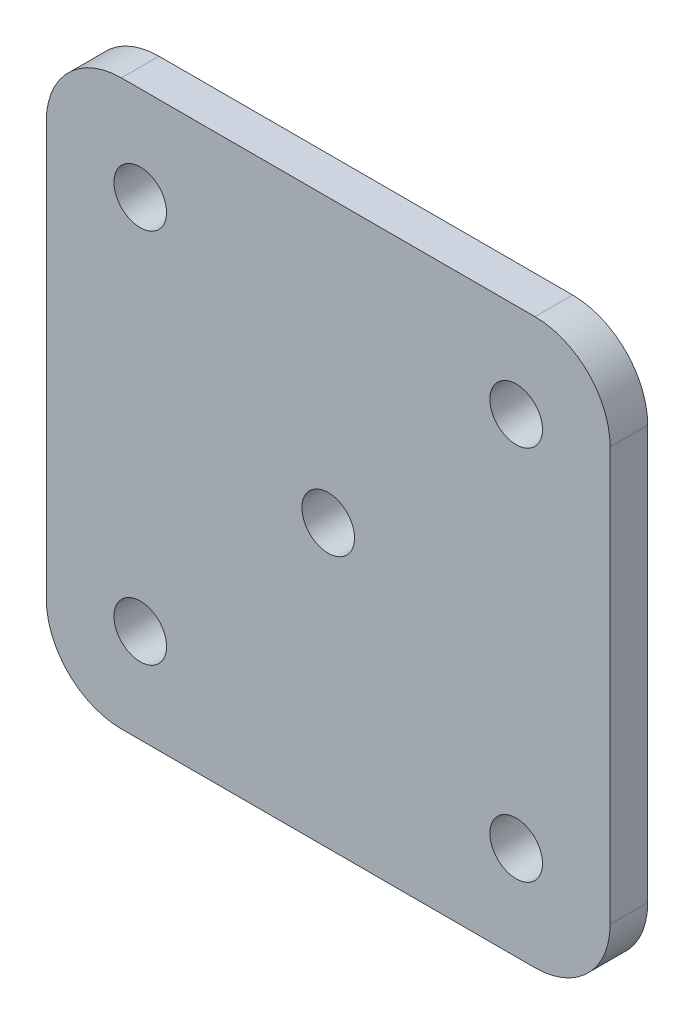
ISO-10303-21;
HEADER;
FILE_DESCRIPTION(('STEP AP214'),'2;1');
FILE_NAME('part.step','',(''),(''),'','','');
FILE_SCHEMA(('AUTOMOTIVE_DESIGN { 1 0 10303 214 1 1 1 1 }'));
ENDSEC;
DATA;
#1=APPLICATION_CONTEXT('core data for automotive mechanical design processes');
#2=APPLICATION_PROTOCOL_DEFINITION('international standard','automotive_design',2000,#1);
#3=PRODUCT_CONTEXT('',#1,'mechanical');
#4=PRODUCT('Part','Part','',(#3));
#5=PRODUCT_RELATED_PRODUCT_CATEGORY('part','',(#4));
#6=PRODUCT_DEFINITION_FORMATION('','',#4);
#7=PRODUCT_DEFINITION_CONTEXT('part definition',#1,'design');
#8=PRODUCT_DEFINITION('design','',#6,#7);
#9=PRODUCT_DEFINITION_SHAPE('','',#8);
#10=(LENGTH_UNIT() NAMED_UNIT(*) SI_UNIT(.MILLI.,.METRE.));
#11=(NAMED_UNIT(*) PLANE_ANGLE_UNIT() SI_UNIT($,.RADIAN.));
#12=(NAMED_UNIT(*) SI_UNIT($,.STERADIAN.) SOLID_ANGLE_UNIT());
#13=UNCERTAINTY_MEASURE_WITH_UNIT(LENGTH_MEASURE(1.E-05),#10,'distance_accuracy_value','');
#14=(GEOMETRIC_REPRESENTATION_CONTEXT(3) GLOBAL_UNCERTAINTY_ASSIGNED_CONTEXT((#13)) GLOBAL_UNIT_ASSIGNED_CONTEXT((#10,
#11,#12)) REPRESENTATION_CONTEXT('',''));
#15=CARTESIAN_POINT('',(0.,0.,0.));
#16=DIRECTION('',(0.,0.,1.));
#17=DIRECTION('',(1.,0.,0.));
#18=AXIS2_PLACEMENT_3D('',#15,#16,#17);
#19=CARTESIAN_POINT('',(-37.5,37.5,5.));
#20=DIRECTION('',(1.,0.,0.));
#21=DIRECTION('',(0.,1.,0.));
#22=AXIS2_PLACEMENT_3D('',#19,#20,#21);
#23=PLANE('',#22);
#24=DIRECTION('',(0.,-1.,0.));
#25=VECTOR('',#24,1.);
#26=CARTESIAN_POINT('',(-37.5,37.5,5.));
#27=LINE('',#26,#25);
#28=CARTESIAN_POINT('',(-37.5,27.5,5.));
#29=VERTEX_POINT('',#28);
#30=CARTESIAN_POINT('',(-37.5,-27.5,5.));
#31=VERTEX_POINT('',#30);
#32=EDGE_CURVE('E117',#29,#31,#27,.T.);
#33=ORIENTED_EDGE('',*,*,#32,.F.);
#34=DIRECTION('',(0.,0.,-1.));
#35=VECTOR('',#34,1.);
#36=CARTESIAN_POINT('',(-37.5,27.5,5.));
#37=LINE('',#36,#35);
#38=CARTESIAN_POINT('',(-37.5,27.5,0.));
#39=VERTEX_POINT('',#38);
#40=EDGE_CURVE('E102',#29,#39,#37,.T.);
#41=ORIENTED_EDGE('',*,*,#40,.T.);
#42=DIRECTION('',(0.,-1.,0.));
#43=VECTOR('',#42,1.);
#44=CARTESIAN_POINT('',(-37.5,37.5,0.));
#45=LINE('',#44,#43);
#46=CARTESIAN_POINT('',(-37.5,-27.5,0.));
#47=VERTEX_POINT('',#46);
#48=EDGE_CURVE('E114',#39,#47,#45,.T.);
#49=ORIENTED_EDGE('',*,*,#48,.T.);
#50=DIRECTION('',(0.,0.,-1.));
#51=VECTOR('',#50,1.);
#52=CARTESIAN_POINT('',(-37.5,-27.5,5.));
#53=LINE('',#52,#51);
#54=EDGE_CURVE('E119',#47,#31,#53,.F.);
#55=ORIENTED_EDGE('',*,*,#54,.T.);
#56=EDGE_LOOP('',(#33,#41,#49,#55));
#57=FACE_BOUND('',#56,.T.);
#58=ADVANCED_FACE('F32',(#57),#23,.F.);
#59=CARTESIAN_POINT('',(-37.5,-37.5,5.));
#60=DIRECTION('',(0.,1.,0.));
#61=DIRECTION('',(-1.,0.,0.));
#62=AXIS2_PLACEMENT_3D('',#59,#60,#61);
#63=PLANE('',#62);
#64=DIRECTION('',(1.,0.,0.));
#65=VECTOR('',#64,1.);
#66=CARTESIAN_POINT('',(-37.5,-37.5,5.));
#67=LINE('',#66,#65);
#68=CARTESIAN_POINT('',(-27.5,-37.5,5.));
#69=VERTEX_POINT('',#68);
#70=CARTESIAN_POINT('',(27.5,-37.5,5.));
#71=VERTEX_POINT('',#70);
#72=EDGE_CURVE('E163',#69,#71,#67,.T.);
#73=ORIENTED_EDGE('',*,*,#72,.F.);
#74=DIRECTION('',(0.,0.,-1.));
#75=VECTOR('',#74,1.);
#76=CARTESIAN_POINT('',(-27.5,-37.5,5.));
#77=LINE('',#76,#75);
#78=CARTESIAN_POINT('',(-27.5,-37.5,0.));
#79=VERTEX_POINT('',#78);
#80=EDGE_CURVE('E156',#69,#79,#77,.T.);
#81=ORIENTED_EDGE('',*,*,#80,.T.);
#82=DIRECTION('',(1.,0.,0.));
#83=VECTOR('',#82,1.);
#84=CARTESIAN_POINT('',(-37.5,-37.5,0.));
#85=LINE('',#84,#83);
#86=CARTESIAN_POINT('',(27.5,-37.5,0.));
#87=VERTEX_POINT('',#86);
#88=EDGE_CURVE('E123',#79,#87,#85,.T.);
#89=ORIENTED_EDGE('',*,*,#88,.T.);
#90=DIRECTION('',(0.,0.,-1.));
#91=VECTOR('',#90,1.);
#92=CARTESIAN_POINT('',(27.5,-37.5,5.));
#93=LINE('',#92,#91);
#94=EDGE_CURVE('E154',#87,#71,#93,.F.);
#95=ORIENTED_EDGE('',*,*,#94,.T.);
#96=EDGE_LOOP('',(#73,#81,#89,#95));
#97=FACE_BOUND('',#96,.T.);
#98=ADVANCED_FACE('F161',(#97),#63,.F.);
#99=CARTESIAN_POINT('',(37.5,37.5,5.));
#100=DIRECTION('',(-1.,0.,0.));
#101=DIRECTION('',(0.,0.,1.));
#102=AXIS2_PLACEMENT_3D('',#99,#100,#101);
#103=PLANE('',#102);
#104=DIRECTION('',(0.,1.,0.));
#105=VECTOR('',#104,1.);
#106=CARTESIAN_POINT('',(37.5,37.5,5.));
#107=LINE('',#106,#105);
#108=CARTESIAN_POINT('',(37.5,-27.5,5.));
#109=VERTEX_POINT('',#108);
#110=CARTESIAN_POINT('',(37.5,27.5,5.));
#111=VERTEX_POINT('',#110);
#112=EDGE_CURVE('E171',#109,#111,#107,.T.);
#113=ORIENTED_EDGE('',*,*,#112,.F.);
#114=DIRECTION('',(0.,0.,-1.));
#115=VECTOR('',#114,1.);
#116=CARTESIAN_POINT('',(37.5,-27.5,5.));
#117=LINE('',#116,#115);
#118=CARTESIAN_POINT('',(37.5,-27.5,0.));
#119=VERTEX_POINT('',#118);
#120=EDGE_CURVE('E11',#109,#119,#117,.T.);
#121=ORIENTED_EDGE('',*,*,#120,.T.);
#122=DIRECTION('',(0.,1.,0.));
#123=VECTOR('',#122,1.);
#124=CARTESIAN_POINT('',(37.5,37.5,0.));
#125=LINE('',#124,#123);
#126=CARTESIAN_POINT('',(37.5,27.5,0.));
#127=VERTEX_POINT('',#126);
#128=EDGE_CURVE('E127',#119,#127,#125,.T.);
#129=ORIENTED_EDGE('',*,*,#128,.T.);
#130=DIRECTION('',(0.,0.,-1.));
#131=VECTOR('',#130,1.);
#132=CARTESIAN_POINT('',(37.5,27.5,5.));
#133=LINE('',#132,#131);
#134=EDGE_CURVE('E40',#127,#111,#133,.F.);
#135=ORIENTED_EDGE('',*,*,#134,.T.);
#136=EDGE_LOOP('',(#113,#121,#129,#135));
#137=FACE_BOUND('',#136,.T.);
#138=ADVANCED_FACE('F170',(#137),#103,.F.);
#139=CARTESIAN_POINT('',(-37.5,37.5,5.));
#140=DIRECTION('',(0.,-1.,0.));
#141=DIRECTION('',(1.,0.,0.));
#142=AXIS2_PLACEMENT_3D('',#139,#140,#141);
#143=PLANE('',#142);
#144=DIRECTION('',(-1.,0.,0.));
#145=VECTOR('',#144,1.);
#146=CARTESIAN_POINT('',(-37.5,37.5,0.));
#147=LINE('',#146,#145);
#148=CARTESIAN_POINT('',(27.5,37.5,0.));
#149=VERTEX_POINT('',#148);
#150=CARTESIAN_POINT('',(-27.5,37.5,0.));
#151=VERTEX_POINT('',#150);
#152=EDGE_CURVE('E137',#149,#151,#147,.T.);
#153=ORIENTED_EDGE('',*,*,#152,.T.);
#154=DIRECTION('',(0.,0.,-1.));
#155=VECTOR('',#154,1.);
#156=CARTESIAN_POINT('',(-27.5,37.5,5.));
#157=LINE('',#156,#155);
#158=CARTESIAN_POINT('',(-27.5,37.5,5.));
#159=VERTEX_POINT('',#158);
#160=EDGE_CURVE('E103',#151,#159,#157,.F.);
#161=ORIENTED_EDGE('',*,*,#160,.T.);
#162=DIRECTION('',(-1.,0.,0.));
#163=VECTOR('',#162,1.);
#164=CARTESIAN_POINT('',(-37.5,37.5,5.));
#165=LINE('',#164,#163);
#166=CARTESIAN_POINT('',(27.5,37.5,5.));
#167=VERTEX_POINT('',#166);
#168=EDGE_CURVE('E133',#167,#159,#165,.T.);
#169=ORIENTED_EDGE('',*,*,#168,.F.);
#170=DIRECTION('',(0.,0.,-1.));
#171=VECTOR('',#170,1.);
#172=CARTESIAN_POINT('',(27.5,37.5,5.));
#173=LINE('',#172,#171);
#174=EDGE_CURVE('E108',#167,#149,#173,.T.);
#175=ORIENTED_EDGE('',*,*,#174,.T.);
#176=EDGE_LOOP('',(#153,#161,#169,#175));
#177=FACE_BOUND('',#176,.T.);
#178=ADVANCED_FACE('F209',(#177),#143,.F.);
#179=CARTESIAN_POINT('',(0.,0.,5.));
#180=DIRECTION('',(0.,0.,1.));
#181=DIRECTION('',(1.,0.,0.));
#182=AXIS2_PLACEMENT_3D('',#179,#180,#181);
#183=PLANE('',#182);
#184=CARTESIAN_POINT('',(0.,0.,5.));
#185=DIRECTION('',(0.,0.,1.));
#186=DIRECTION('',(1.,0.,0.));
#187=AXIS2_PLACEMENT_3D('',#184,#185,#186);
#188=CIRCLE('',#187,3.5);
#189=CARTESIAN_POINT('',(3.5,0.,5.));
#190=VERTEX_POINT('',#189);
#191=EDGE_CURVE('E200',#190,#190,#188,.T.);
#192=ORIENTED_EDGE('',*,*,#191,.F.);
#193=EDGE_LOOP('',(#192));
#194=FACE_BOUND('',#193,.T.);
#195=CARTESIAN_POINT('',(-25.,25.,5.));
#196=DIRECTION('',(0.,0.,1.));
#197=DIRECTION('',(1.,0.,0.));
#198=AXIS2_PLACEMENT_3D('',#195,#196,#197);
#199=CIRCLE('',#198,3.5);
#200=CARTESIAN_POINT('',(-21.5,25.,5.));
#201=VERTEX_POINT('',#200);
#202=EDGE_CURVE('E194',#201,#201,#199,.T.);
#203=ORIENTED_EDGE('',*,*,#202,.F.);
#204=EDGE_LOOP('',(#203));
#205=FACE_BOUND('',#204,.T.);
#206=CARTESIAN_POINT('',(-25.,-25.,5.));
#207=DIRECTION('',(0.,0.,1.));
#208=DIRECTION('',(1.,0.,0.));
#209=AXIS2_PLACEMENT_3D('',#206,#207,#208);
#210=CIRCLE('',#209,3.5);
#211=CARTESIAN_POINT('',(-21.5,-25.,5.));
#212=VERTEX_POINT('',#211);
#213=EDGE_CURVE('E188',#212,#212,#210,.T.);
#214=ORIENTED_EDGE('',*,*,#213,.F.);
#215=EDGE_LOOP('',(#214));
#216=FACE_BOUND('',#215,.T.);
#217=CARTESIAN_POINT('',(25.,-25.,5.));
#218=DIRECTION('',(0.,0.,1.));
#219=DIRECTION('',(1.,0.,0.));
#220=AXIS2_PLACEMENT_3D('',#217,#218,#219);
#221=CIRCLE('',#220,3.5);
#222=CARTESIAN_POINT('',(28.5,-25.,5.));
#223=VERTEX_POINT('',#222);
#224=EDGE_CURVE('E182',#223,#223,#221,.T.);
#225=ORIENTED_EDGE('',*,*,#224,.F.);
#226=EDGE_LOOP('',(#225));
#227=FACE_BOUND('',#226,.T.);
#228=CARTESIAN_POINT('',(25.,25.,5.));
#229=DIRECTION('',(0.,0.,1.));
#230=DIRECTION('',(1.,0.,0.));
#231=AXIS2_PLACEMENT_3D('',#228,#229,#230);
#232=CIRCLE('',#231,3.5);
#233=CARTESIAN_POINT('',(28.5,25.,5.));
#234=VERTEX_POINT('',#233);
#235=EDGE_CURVE('E130',#234,#234,#232,.T.);
#236=ORIENTED_EDGE('',*,*,#235,.F.);
#237=EDGE_LOOP('',(#236));
#238=FACE_BOUND('',#237,.T.);
#239=ORIENTED_EDGE('',*,*,#168,.T.);
#240=CARTESIAN_POINT('',(-27.5,27.5,5.));
#241=DIRECTION('',(0.,0.,1.));
#242=DIRECTION('',(1.,0.,0.));
#243=AXIS2_PLACEMENT_3D('',#240,#241,#242);
#244=CIRCLE('',#243,10.);
#245=EDGE_CURVE('E152',#159,#29,#244,.T.);
#246=ORIENTED_EDGE('',*,*,#245,.T.);
#247=ORIENTED_EDGE('',*,*,#32,.T.);
#248=CARTESIAN_POINT('',(-27.5,-27.5,5.));
#249=DIRECTION('',(0.,0.,1.));
#250=DIRECTION('',(1.,0.,0.));
#251=AXIS2_PLACEMENT_3D('',#248,#249,#250);
#252=CIRCLE('',#251,10.);
#253=EDGE_CURVE('E150',#31,#69,#252,.T.);
#254=ORIENTED_EDGE('',*,*,#253,.T.);
#255=ORIENTED_EDGE('',*,*,#72,.T.);
#256=CARTESIAN_POINT('',(27.5,-27.5,5.));
#257=DIRECTION('',(0.,0.,1.));
#258=DIRECTION('',(1.,0.,0.));
#259=AXIS2_PLACEMENT_3D('',#256,#257,#258);
#260=CIRCLE('',#259,10.);
#261=EDGE_CURVE('E53',#71,#109,#260,.T.);
#262=ORIENTED_EDGE('',*,*,#261,.T.);
#263=ORIENTED_EDGE('',*,*,#112,.T.);
#264=CARTESIAN_POINT('',(27.5,27.5,5.));
#265=DIRECTION('',(0.,0.,1.));
#266=DIRECTION('',(1.,0.,0.));
#267=AXIS2_PLACEMENT_3D('',#264,#265,#266);
#268=CIRCLE('',#267,10.);
#269=EDGE_CURVE('E147',#111,#167,#268,.T.);
#270=ORIENTED_EDGE('',*,*,#269,.T.);
#271=EDGE_LOOP('',(#239,#246,#247,#254,#255,#262,#263,#270));
#272=FACE_BOUND('',#271,.T.);
#273=ADVANCED_FACE('F206',(#194,#205,#216,#227,#238,#272),#183,.T.);
#274=CARTESIAN_POINT('',(0.,0.,0.));
#275=DIRECTION('',(0.,0.,1.));
#276=DIRECTION('',(1.,0.,0.));
#277=AXIS2_PLACEMENT_3D('',#274,#275,#276);
#278=PLANE('',#277);
#279=CARTESIAN_POINT('',(0.,0.,0.));
#280=DIRECTION('',(0.,0.,1.));
#281=DIRECTION('',(1.,0.,0.));
#282=AXIS2_PLACEMENT_3D('',#279,#280,#281);
#283=CIRCLE('',#282,3.5);
#284=CARTESIAN_POINT('',(3.5,0.,0.));
#285=VERTEX_POINT('',#284);
#286=EDGE_CURVE('E197',#285,#285,#283,.T.);
#287=ORIENTED_EDGE('',*,*,#286,.T.);
#288=EDGE_LOOP('',(#287));
#289=FACE_BOUND('',#288,.T.);
#290=CARTESIAN_POINT('',(-25.,25.,0.));
#291=DIRECTION('',(0.,0.,1.));
#292=DIRECTION('',(1.,0.,0.));
#293=AXIS2_PLACEMENT_3D('',#290,#291,#292);
#294=CIRCLE('',#293,3.5);
#295=CARTESIAN_POINT('',(-21.5,25.,0.));
#296=VERTEX_POINT('',#295);
#297=EDGE_CURVE('E191',#296,#296,#294,.T.);
#298=ORIENTED_EDGE('',*,*,#297,.T.);
#299=EDGE_LOOP('',(#298));
#300=FACE_BOUND('',#299,.T.);
#301=CARTESIAN_POINT('',(-25.,-25.,0.));
#302=DIRECTION('',(0.,0.,1.));
#303=DIRECTION('',(1.,0.,0.));
#304=AXIS2_PLACEMENT_3D('',#301,#302,#303);
#305=CIRCLE('',#304,3.5);
#306=CARTESIAN_POINT('',(-21.5,-25.,0.));
#307=VERTEX_POINT('',#306);
#308=EDGE_CURVE('E185',#307,#307,#305,.T.);
#309=ORIENTED_EDGE('',*,*,#308,.T.);
#310=EDGE_LOOP('',(#309));
#311=FACE_BOUND('',#310,.T.);
#312=CARTESIAN_POINT('',(25.,-25.,0.));
#313=DIRECTION('',(0.,0.,1.));
#314=DIRECTION('',(1.,0.,0.));
#315=AXIS2_PLACEMENT_3D('',#312,#313,#314);
#316=CIRCLE('',#315,3.5);
#317=CARTESIAN_POINT('',(28.5,-25.,0.));
#318=VERTEX_POINT('',#317);
#319=EDGE_CURVE('E179',#318,#318,#316,.T.);
#320=ORIENTED_EDGE('',*,*,#319,.T.);
#321=EDGE_LOOP('',(#320));
#322=FACE_BOUND('',#321,.T.);
#323=CARTESIAN_POINT('',(25.,25.,0.));
#324=DIRECTION('',(0.,0.,1.));
#325=DIRECTION('',(1.,0.,0.));
#326=AXIS2_PLACEMENT_3D('',#323,#324,#325);
#327=CIRCLE('',#326,3.5);
#328=CARTESIAN_POINT('',(28.5,25.,0.));
#329=VERTEX_POINT('',#328);
#330=EDGE_CURVE('E124',#329,#329,#327,.T.);
#331=ORIENTED_EDGE('',*,*,#330,.T.);
#332=EDGE_LOOP('',(#331));
#333=FACE_BOUND('',#332,.T.);
#334=ORIENTED_EDGE('',*,*,#48,.F.);
#335=CARTESIAN_POINT('',(-27.5,27.5,0.));
#336=DIRECTION('',(0.,0.,1.));
#337=DIRECTION('',(1.,0.,0.));
#338=AXIS2_PLACEMENT_3D('',#335,#336,#337);
#339=CIRCLE('',#338,10.);
#340=EDGE_CURVE('E98',#39,#151,#339,.F.);
#341=ORIENTED_EDGE('',*,*,#340,.T.);
#342=ORIENTED_EDGE('',*,*,#152,.F.);
#343=CARTESIAN_POINT('',(27.5,27.5,0.));
#344=DIRECTION('',(0.,0.,1.));
#345=DIRECTION('',(1.,0.,0.));
#346=AXIS2_PLACEMENT_3D('',#343,#344,#345);
#347=CIRCLE('',#346,10.);
#348=EDGE_CURVE('E118',#149,#127,#347,.F.);
#349=ORIENTED_EDGE('',*,*,#348,.T.);
#350=ORIENTED_EDGE('',*,*,#128,.F.);
#351=CARTESIAN_POINT('',(27.5,-27.5,0.));
#352=DIRECTION('',(0.,0.,1.));
#353=DIRECTION('',(1.,0.,0.));
#354=AXIS2_PLACEMENT_3D('',#351,#352,#353);
#355=CIRCLE('',#354,10.);
#356=EDGE_CURVE('E141',#119,#87,#355,.F.);
#357=ORIENTED_EDGE('',*,*,#356,.T.);
#358=ORIENTED_EDGE('',*,*,#88,.F.);
#359=CARTESIAN_POINT('',(-27.5,-27.5,0.));
#360=DIRECTION('',(0.,0.,1.));
#361=DIRECTION('',(1.,0.,0.));
#362=AXIS2_PLACEMENT_3D('',#359,#360,#361);
#363=CIRCLE('',#362,10.);
#364=EDGE_CURVE('E109',#79,#47,#363,.F.);
#365=ORIENTED_EDGE('',*,*,#364,.T.);
#366=EDGE_LOOP('',(#334,#341,#342,#349,#350,#357,#358,#365));
#367=FACE_BOUND('',#366,.T.);
#368=ADVANCED_FACE('F121',(#289,#300,#311,#322,#333,#367),#278,.F.);
#369=CARTESIAN_POINT('',(25.,25.,5.));
#370=DIRECTION('',(0.,0.,1.));
#371=DIRECTION('',(1.,0.,0.));
#372=AXIS2_PLACEMENT_3D('',#369,#370,#371);
#373=CYLINDRICAL_SURFACE('',#372,3.5);
#374=ORIENTED_EDGE('',*,*,#330,.F.);
#375=EDGE_LOOP('',(#374));
#376=FACE_BOUND('',#375,.T.);
#377=ORIENTED_EDGE('',*,*,#235,.T.);
#378=EDGE_LOOP('',(#377));
#379=FACE_BOUND('',#378,.T.);
#380=ADVANCED_FACE('F273',(#376,#379),#373,.F.);
#381=CARTESIAN_POINT('',(25.,-25.,5.));
#382=DIRECTION('',(0.,0.,1.));
#383=DIRECTION('',(1.,0.,0.));
#384=AXIS2_PLACEMENT_3D('',#381,#382,#383);
#385=CYLINDRICAL_SURFACE('',#384,3.5);
#386=ORIENTED_EDGE('',*,*,#319,.F.);
#387=EDGE_LOOP('',(#386));
#388=FACE_BOUND('',#387,.T.);
#389=ORIENTED_EDGE('',*,*,#224,.T.);
#390=EDGE_LOOP('',(#389));
#391=FACE_BOUND('',#390,.T.);
#392=ADVANCED_FACE('F288',(#388,#391),#385,.F.);
#393=CARTESIAN_POINT('',(-25.,-25.,5.));
#394=DIRECTION('',(0.,0.,1.));
#395=DIRECTION('',(1.,0.,0.));
#396=AXIS2_PLACEMENT_3D('',#393,#394,#395);
#397=CYLINDRICAL_SURFACE('',#396,3.5);
#398=ORIENTED_EDGE('',*,*,#308,.F.);
#399=EDGE_LOOP('',(#398));
#400=FACE_BOUND('',#399,.T.);
#401=ORIENTED_EDGE('',*,*,#213,.T.);
#402=EDGE_LOOP('',(#401));
#403=FACE_BOUND('',#402,.T.);
#404=ADVANCED_FACE('F295',(#400,#403),#397,.F.);
#405=CARTESIAN_POINT('',(-25.,25.,5.));
#406=DIRECTION('',(0.,0.,1.));
#407=DIRECTION('',(1.,0.,0.));
#408=AXIS2_PLACEMENT_3D('',#405,#406,#407);
#409=CYLINDRICAL_SURFACE('',#408,3.5);
#410=ORIENTED_EDGE('',*,*,#297,.F.);
#411=EDGE_LOOP('',(#410));
#412=FACE_BOUND('',#411,.T.);
#413=ORIENTED_EDGE('',*,*,#202,.T.);
#414=EDGE_LOOP('',(#413));
#415=FACE_BOUND('',#414,.T.);
#416=ADVANCED_FACE('F240',(#412,#415),#409,.F.);
#417=CARTESIAN_POINT('',(-27.5,27.5,5.));
#418=DIRECTION('',(0.,0.,-1.));
#419=DIRECTION('',(-1.,0.,0.));
#420=AXIS2_PLACEMENT_3D('',#417,#418,#419);
#421=CYLINDRICAL_SURFACE('',#420,10.);
#422=ORIENTED_EDGE('',*,*,#245,.F.);
#423=ORIENTED_EDGE('',*,*,#160,.F.);
#424=ORIENTED_EDGE('',*,*,#340,.F.);
#425=ORIENTED_EDGE('',*,*,#40,.F.);
#426=EDGE_LOOP('',(#422,#423,#424,#425));
#427=FACE_BOUND('',#426,.T.);
#428=ADVANCED_FACE('F101',(#427),#421,.T.);
#429=CARTESIAN_POINT('',(-27.5,-27.5,5.));
#430=DIRECTION('',(0.,0.,-1.));
#431=DIRECTION('',(-1.,0.,0.));
#432=AXIS2_PLACEMENT_3D('',#429,#430,#431);
#433=CYLINDRICAL_SURFACE('',#432,10.);
#434=ORIENTED_EDGE('',*,*,#253,.F.);
#435=ORIENTED_EDGE('',*,*,#54,.F.);
#436=ORIENTED_EDGE('',*,*,#364,.F.);
#437=ORIENTED_EDGE('',*,*,#80,.F.);
#438=EDGE_LOOP('',(#434,#435,#436,#437));
#439=FACE_BOUND('',#438,.T.);
#440=ADVANCED_FACE('F229',(#439),#433,.T.);
#441=CARTESIAN_POINT('',(27.5,-27.5,5.));
#442=DIRECTION('',(0.,0.,-1.));
#443=DIRECTION('',(-1.,0.,0.));
#444=AXIS2_PLACEMENT_3D('',#441,#442,#443);
#445=CYLINDRICAL_SURFACE('',#444,10.);
#446=ORIENTED_EDGE('',*,*,#261,.F.);
#447=ORIENTED_EDGE('',*,*,#94,.F.);
#448=ORIENTED_EDGE('',*,*,#356,.F.);
#449=ORIENTED_EDGE('',*,*,#120,.F.);
#450=EDGE_LOOP('',(#446,#447,#448,#449));
#451=FACE_BOUND('',#450,.T.);
#452=ADVANCED_FACE('F169',(#451),#445,.T.);
#453=CARTESIAN_POINT('',(27.5,27.5,5.));
#454=DIRECTION('',(0.,0.,-1.));
#455=DIRECTION('',(-1.,0.,0.));
#456=AXIS2_PLACEMENT_3D('',#453,#454,#455);
#457=CYLINDRICAL_SURFACE('',#456,10.);
#458=ORIENTED_EDGE('',*,*,#269,.F.);
#459=ORIENTED_EDGE('',*,*,#134,.F.);
#460=ORIENTED_EDGE('',*,*,#348,.F.);
#461=ORIENTED_EDGE('',*,*,#174,.F.);
#462=EDGE_LOOP('',(#458,#459,#460,#461));
#463=FACE_BOUND('',#462,.T.);
#464=ADVANCED_FACE('F34',(#463),#457,.T.);
#465=CARTESIAN_POINT('',(0.,0.,5.));
#466=DIRECTION('',(0.,0.,1.));
#467=DIRECTION('',(1.,0.,0.));
#468=AXIS2_PLACEMENT_3D('',#465,#466,#467);
#469=CYLINDRICAL_SURFACE('',#468,3.5);
#470=ORIENTED_EDGE('',*,*,#286,.F.);
#471=EDGE_LOOP('',(#470));
#472=FACE_BOUND('',#471,.T.);
#473=ORIENTED_EDGE('',*,*,#191,.T.);
#474=EDGE_LOOP('',(#473));
#475=FACE_BOUND('',#474,.T.);
#476=ADVANCED_FACE('F204',(#472,#475),#469,.F.);
#477=CLOSED_SHELL('',(#58,#98,#138,#178,#273,#368,#380,#392,#404,#416,#428,#440,#452,#464,#476));
#478=MANIFOLD_SOLID_BREP('B2',#477);
#479=ADVANCED_BREP_SHAPE_REPRESENTATION('',(#18,#478),#14);
#480=SHAPE_DEFINITION_REPRESENTATION(#9,#479);
ENDSEC;
END-ISO-10303-21;
